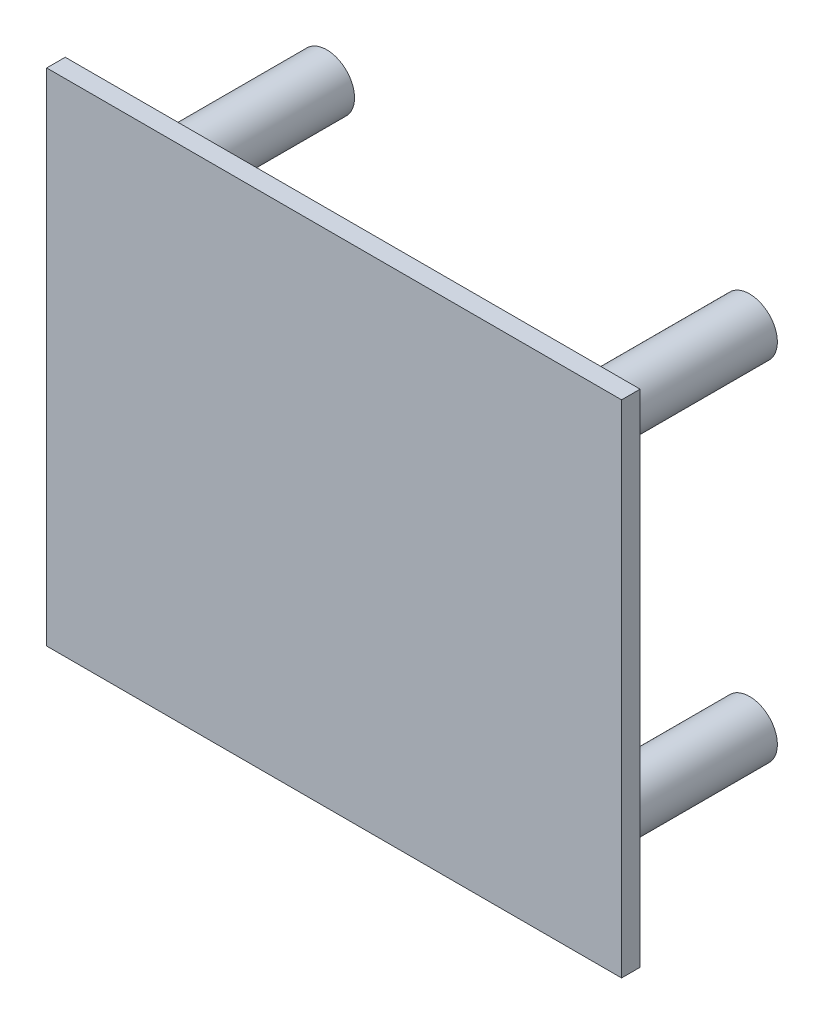
ISO-10303-21;
HEADER;
FILE_DESCRIPTION(('STEP AP214'),'2;1');
FILE_NAME('part.step','',(''),(''),'','','');
FILE_SCHEMA(('AUTOMOTIVE_DESIGN { 1 0 10303 214 1 1 1 1 }'));
ENDSEC;
DATA;
#1=APPLICATION_CONTEXT('core data for automotive mechanical design processes');
#2=APPLICATION_PROTOCOL_DEFINITION('international standard','automotive_design',2000,#1);
#3=PRODUCT_CONTEXT('',#1,'mechanical');
#4=PRODUCT('Part','Part','',(#3));
#5=PRODUCT_RELATED_PRODUCT_CATEGORY('part','',(#4));
#6=PRODUCT_DEFINITION_FORMATION('','',#4);
#7=PRODUCT_DEFINITION_CONTEXT('part definition',#1,'design');
#8=PRODUCT_DEFINITION('design','',#6,#7);
#9=PRODUCT_DEFINITION_SHAPE('','',#8);
#10=(LENGTH_UNIT() NAMED_UNIT(*) SI_UNIT(.MILLI.,.METRE.));
#11=(NAMED_UNIT(*) PLANE_ANGLE_UNIT() SI_UNIT($,.RADIAN.));
#12=(NAMED_UNIT(*) SI_UNIT($,.STERADIAN.) SOLID_ANGLE_UNIT());
#13=UNCERTAINTY_MEASURE_WITH_UNIT(LENGTH_MEASURE(1.E-05),#10,'distance_accuracy_value','');
#14=(GEOMETRIC_REPRESENTATION_CONTEXT(3) GLOBAL_UNCERTAINTY_ASSIGNED_CONTEXT((#13)) GLOBAL_UNIT_ASSIGNED_CONTEXT((#10,
#11,#12)) REPRESENTATION_CONTEXT('',''));
#15=CARTESIAN_POINT('',(0.,0.,0.));
#16=DIRECTION('',(0.,0.,1.));
#17=DIRECTION('',(1.,0.,0.));
#18=AXIS2_PLACEMENT_3D('',#15,#16,#17);
#19=CARTESIAN_POINT('',(15.5,13.5,0.));
#20=DIRECTION('',(0.,0.,-1.));
#21=DIRECTION('',(-1.,0.,0.));
#22=AXIS2_PLACEMENT_3D('',#19,#20,#21);
#23=PLANE('',#22);
#24=CARTESIAN_POINT('',(-11.4,-9.4,0.));
#25=DIRECTION('',(0.,0.,-1.));
#26=DIRECTION('',(-1.,0.,0.));
#27=AXIS2_PLACEMENT_3D('',#24,#25,#26);
#28=CIRCLE('',#27,1.5);
#29=CARTESIAN_POINT('',(-12.9,-9.4,0.));
#30=VERTEX_POINT('',#29);
#31=EDGE_CURVE('E11',#30,#30,#28,.T.);
#32=ORIENTED_EDGE('',*,*,#31,.F.);
#33=EDGE_LOOP('',(#32));
#34=FACE_BOUND('',#33,.T.);
#35=CARTESIAN_POINT('',(11.4,-9.4,0.));
#36=DIRECTION('',(0.,0.,-1.));
#37=DIRECTION('',(-1.,0.,0.));
#38=AXIS2_PLACEMENT_3D('',#35,#36,#37);
#39=CIRCLE('',#38,1.5);
#40=CARTESIAN_POINT('',(9.9,-9.4,0.));
#41=VERTEX_POINT('',#40);
#42=EDGE_CURVE('E134',#41,#41,#39,.T.);
#43=ORIENTED_EDGE('',*,*,#42,.F.);
#44=EDGE_LOOP('',(#43));
#45=FACE_BOUND('',#44,.T.);
#46=DIRECTION('',(0.,1.,0.));
#47=VECTOR('',#46,1.);
#48=CARTESIAN_POINT('',(15.5,-13.5,0.));
#49=LINE('',#48,#47);
#50=CARTESIAN_POINT('',(15.5,-13.5,0.));
#51=VERTEX_POINT('',#50);
#52=CARTESIAN_POINT('',(15.5,13.5,0.));
#53=VERTEX_POINT('',#52);
#54=EDGE_CURVE('E101',#51,#53,#49,.T.);
#55=ORIENTED_EDGE('',*,*,#54,.F.);
#56=DIRECTION('',(1.,0.,0.));
#57=VECTOR('',#56,1.);
#58=CARTESIAN_POINT('',(-15.5,-13.5,0.));
#59=LINE('',#58,#57);
#60=CARTESIAN_POINT('',(-15.5,-13.5,0.));
#61=VERTEX_POINT('',#60);
#62=EDGE_CURVE('E73',#61,#51,#59,.T.);
#63=ORIENTED_EDGE('',*,*,#62,.F.);
#64=DIRECTION('',(0.,-1.,0.));
#65=VECTOR('',#64,1.);
#66=CARTESIAN_POINT('',(-15.5,-13.5,0.));
#67=LINE('',#66,#65);
#68=CARTESIAN_POINT('',(-15.5,13.5,0.));
#69=VERTEX_POINT('',#68);
#70=EDGE_CURVE('E67',#69,#61,#67,.T.);
#71=ORIENTED_EDGE('',*,*,#70,.F.);
#72=DIRECTION('',(-1.,0.,0.));
#73=VECTOR('',#72,1.);
#74=CARTESIAN_POINT('',(-15.5,13.5,0.));
#75=LINE('',#74,#73);
#76=EDGE_CURVE('E91',#53,#69,#75,.T.);
#77=ORIENTED_EDGE('',*,*,#76,.F.);
#78=EDGE_LOOP('',(#55,#63,#71,#77));
#79=FACE_BOUND('',#78,.T.);
#80=CARTESIAN_POINT('',(11.4,9.4,0.));
#81=DIRECTION('',(0.,0.,-1.));
#82=DIRECTION('',(-1.,0.,0.));
#83=AXIS2_PLACEMENT_3D('',#80,#81,#82);
#84=CIRCLE('',#83,1.5);
#85=CARTESIAN_POINT('',(9.9,9.4,0.));
#86=VERTEX_POINT('',#85);
#87=EDGE_CURVE('E42',#86,#86,#84,.T.);
#88=ORIENTED_EDGE('',*,*,#87,.F.);
#89=EDGE_LOOP('',(#88));
#90=FACE_BOUND('',#89,.T.);
#91=CARTESIAN_POINT('',(-11.4,9.4,0.));
#92=DIRECTION('',(0.,0.,-1.));
#93=DIRECTION('',(1.,0.,0.));
#94=AXIS2_PLACEMENT_3D('',#91,#92,#93);
#95=CIRCLE('',#94,1.5);
#96=CARTESIAN_POINT('',(-9.9,9.4,0.));
#97=VERTEX_POINT('',#96);
#98=EDGE_CURVE('E121',#97,#97,#95,.T.);
#99=ORIENTED_EDGE('',*,*,#98,.F.);
#100=EDGE_LOOP('',(#99));
#101=FACE_BOUND('',#100,.T.);
#102=ADVANCED_FACE('F33',(#34,#45,#79,#90,#101),#23,.T.);
#103=CARTESIAN_POINT('',(15.5,-13.5,1.));
#104=DIRECTION('',(-1.,0.,0.));
#105=DIRECTION('',(0.,0.,1.));
#106=AXIS2_PLACEMENT_3D('',#103,#104,#105);
#107=PLANE('',#106);
#108=ORIENTED_EDGE('',*,*,#54,.T.);
#109=DIRECTION('',(0.,0.,-1.));
#110=VECTOR('',#109,1.);
#111=CARTESIAN_POINT('',(15.5,13.5,1.));
#112=LINE('',#111,#110);
#113=CARTESIAN_POINT('',(15.5,13.5,1.));
#114=VERTEX_POINT('',#113);
#115=EDGE_CURVE('E92',#114,#53,#112,.T.);
#116=ORIENTED_EDGE('',*,*,#115,.F.);
#117=DIRECTION('',(0.,1.,0.));
#118=VECTOR('',#117,1.);
#119=CARTESIAN_POINT('',(15.5,-13.5,1.));
#120=LINE('',#119,#118);
#121=CARTESIAN_POINT('',(15.5,-13.5,1.));
#122=VERTEX_POINT('',#121);
#123=EDGE_CURVE('E86',#122,#114,#120,.T.);
#124=ORIENTED_EDGE('',*,*,#123,.F.);
#125=DIRECTION('',(0.,0.,-1.));
#126=VECTOR('',#125,1.);
#127=CARTESIAN_POINT('',(15.5,-13.5,1.));
#128=LINE('',#127,#126);
#129=EDGE_CURVE('E97',#122,#51,#128,.T.);
#130=ORIENTED_EDGE('',*,*,#129,.T.);
#131=EDGE_LOOP('',(#108,#116,#124,#130));
#132=FACE_BOUND('',#131,.T.);
#133=ADVANCED_FACE('F35',(#132),#107,.F.);
#134=CARTESIAN_POINT('',(-15.5,13.5,1.));
#135=DIRECTION('',(0.,-1.,0.));
#136=DIRECTION('',(0.,0.,-1.));
#137=AXIS2_PLACEMENT_3D('',#134,#135,#136);
#138=PLANE('',#137);
#139=ORIENTED_EDGE('',*,*,#76,.T.);
#140=DIRECTION('',(0.,0.,-1.));
#141=VECTOR('',#140,1.);
#142=CARTESIAN_POINT('',(-15.5,13.5,1.));
#143=LINE('',#142,#141);
#144=CARTESIAN_POINT('',(-15.5,13.5,1.));
#145=VERTEX_POINT('',#144);
#146=EDGE_CURVE('E89',#145,#69,#143,.T.);
#147=ORIENTED_EDGE('',*,*,#146,.F.);
#148=DIRECTION('',(-1.,0.,0.));
#149=VECTOR('',#148,1.);
#150=CARTESIAN_POINT('',(-15.5,13.5,1.));
#151=LINE('',#150,#149);
#152=EDGE_CURVE('E81',#114,#145,#151,.T.);
#153=ORIENTED_EDGE('',*,*,#152,.F.);
#154=ORIENTED_EDGE('',*,*,#115,.T.);
#155=EDGE_LOOP('',(#139,#147,#153,#154));
#156=FACE_BOUND('',#155,.T.);
#157=ADVANCED_FACE('F90',(#156),#138,.F.);
#158=CARTESIAN_POINT('',(-15.5,-13.5,1.));
#159=DIRECTION('',(1.,0.,0.));
#160=DIRECTION('',(0.,0.,-1.));
#161=AXIS2_PLACEMENT_3D('',#158,#159,#160);
#162=PLANE('',#161);
#163=ORIENTED_EDGE('',*,*,#70,.T.);
#164=DIRECTION('',(0.,0.,-1.));
#165=VECTOR('',#164,1.);
#166=CARTESIAN_POINT('',(-15.5,-13.5,1.));
#167=LINE('',#166,#165);
#168=CARTESIAN_POINT('',(-15.5,-13.5,1.));
#169=VERTEX_POINT('',#168);
#170=EDGE_CURVE('E93',#169,#61,#167,.T.);
#171=ORIENTED_EDGE('',*,*,#170,.F.);
#172=DIRECTION('',(0.,-1.,0.));
#173=VECTOR('',#172,1.);
#174=CARTESIAN_POINT('',(-15.5,-13.5,1.));
#175=LINE('',#174,#173);
#176=EDGE_CURVE('E84',#145,#169,#175,.T.);
#177=ORIENTED_EDGE('',*,*,#176,.F.);
#178=ORIENTED_EDGE('',*,*,#146,.T.);
#179=EDGE_LOOP('',(#163,#171,#177,#178));
#180=FACE_BOUND('',#179,.T.);
#181=ADVANCED_FACE('F95',(#180),#162,.F.);
#182=CARTESIAN_POINT('',(-15.5,-13.5,1.));
#183=DIRECTION('',(0.,1.,0.));
#184=DIRECTION('',(0.,0.,1.));
#185=AXIS2_PLACEMENT_3D('',#182,#183,#184);
#186=PLANE('',#185);
#187=ORIENTED_EDGE('',*,*,#62,.T.);
#188=ORIENTED_EDGE('',*,*,#129,.F.);
#189=DIRECTION('',(1.,0.,0.));
#190=VECTOR('',#189,1.);
#191=CARTESIAN_POINT('',(-15.5,-13.5,1.));
#192=LINE('',#191,#190);
#193=EDGE_CURVE('E50',#169,#122,#192,.T.);
#194=ORIENTED_EDGE('',*,*,#193,.F.);
#195=ORIENTED_EDGE('',*,*,#170,.T.);
#196=EDGE_LOOP('',(#187,#188,#194,#195));
#197=FACE_BOUND('',#196,.T.);
#198=ADVANCED_FACE('F145',(#197),#186,.F.);
#199=CARTESIAN_POINT('',(15.5,13.5,1.));
#200=DIRECTION('',(0.,0.,-1.));
#201=DIRECTION('',(-1.,0.,0.));
#202=AXIS2_PLACEMENT_3D('',#199,#200,#201);
#203=PLANE('',#202);
#204=ORIENTED_EDGE('',*,*,#123,.T.);
#205=ORIENTED_EDGE('',*,*,#152,.T.);
#206=ORIENTED_EDGE('',*,*,#176,.T.);
#207=ORIENTED_EDGE('',*,*,#193,.T.);
#208=EDGE_LOOP('',(#204,#205,#206,#207));
#209=FACE_BOUND('',#208,.T.);
#210=ADVANCED_FACE('F82',(#209),#203,.F.);
#211=CARTESIAN_POINT('',(11.4,-9.4,-10.));
#212=DIRECTION('',(0.,0.,1.));
#213=DIRECTION('',(1.,0.,0.));
#214=AXIS2_PLACEMENT_3D('',#211,#212,#213);
#215=CYLINDRICAL_SURFACE('',#214,1.5);
#216=CARTESIAN_POINT('',(11.4,-9.4,-10.));
#217=DIRECTION('',(0.,0.,-1.));
#218=DIRECTION('',(-1.,0.,0.));
#219=AXIS2_PLACEMENT_3D('',#216,#217,#218);
#220=CIRCLE('',#219,1.5);
#221=CARTESIAN_POINT('',(9.9,-9.4,-10.));
#222=VERTEX_POINT('',#221);
#223=EDGE_CURVE('E104',#222,#222,#220,.T.);
#224=ORIENTED_EDGE('',*,*,#223,.F.);
#225=EDGE_LOOP('',(#224));
#226=FACE_BOUND('',#225,.T.);
#227=ORIENTED_EDGE('',*,*,#42,.T.);
#228=EDGE_LOOP('',(#227));
#229=FACE_BOUND('',#228,.T.);
#230=ADVANCED_FACE('F140',(#226,#229),#215,.T.);
#231=CARTESIAN_POINT('',(11.4,-9.4,-10.));
#232=DIRECTION('',(0.,0.,-1.));
#233=DIRECTION('',(-1.,0.,0.));
#234=AXIS2_PLACEMENT_3D('',#231,#232,#233);
#235=PLANE('',#234);
#236=ORIENTED_EDGE('',*,*,#223,.T.);
#237=EDGE_LOOP('',(#236));
#238=FACE_BOUND('',#237,.T.);
#239=ADVANCED_FACE('F220',(#238),#235,.T.);
#240=CARTESIAN_POINT('',(11.4,9.4,-10.));
#241=DIRECTION('',(0.,0.,1.));
#242=DIRECTION('',(1.,0.,0.));
#243=AXIS2_PLACEMENT_3D('',#240,#241,#242);
#244=CYLINDRICAL_SURFACE('',#243,1.5);
#245=CARTESIAN_POINT('',(11.4,9.4,-10.));
#246=DIRECTION('',(0.,0.,1.));
#247=DIRECTION('',(-1.,0.,0.));
#248=AXIS2_PLACEMENT_3D('',#245,#246,#247);
#249=CIRCLE('',#248,1.5);
#250=CARTESIAN_POINT('',(9.9,9.4,-10.));
#251=VERTEX_POINT('',#250);
#252=EDGE_CURVE('E127',#251,#251,#249,.T.);
#253=ORIENTED_EDGE('',*,*,#252,.T.);
#254=EDGE_LOOP('',(#253));
#255=FACE_BOUND('',#254,.T.);
#256=ORIENTED_EDGE('',*,*,#87,.T.);
#257=EDGE_LOOP('',(#256));
#258=FACE_BOUND('',#257,.T.);
#259=ADVANCED_FACE('F113',(#255,#258),#244,.T.);
#260=CARTESIAN_POINT('',(11.4,9.4,-10.));
#261=DIRECTION('',(0.,0.,-1.));
#262=DIRECTION('',(-1.,0.,0.));
#263=AXIS2_PLACEMENT_3D('',#260,#261,#262);
#264=PLANE('',#263);
#265=ORIENTED_EDGE('',*,*,#252,.F.);
#266=EDGE_LOOP('',(#265));
#267=FACE_BOUND('',#266,.T.);
#268=ADVANCED_FACE('F172',(#267),#264,.T.);
#269=CARTESIAN_POINT('',(-11.4,9.4,-10.));
#270=DIRECTION('',(0.,0.,1.));
#271=DIRECTION('',(1.,0.,0.));
#272=AXIS2_PLACEMENT_3D('',#269,#270,#271);
#273=CYLINDRICAL_SURFACE('',#272,1.5);
#274=CARTESIAN_POINT('',(-11.4,9.4,-10.));
#275=DIRECTION('',(0.,0.,-1.));
#276=DIRECTION('',(1.,0.,0.));
#277=AXIS2_PLACEMENT_3D('',#274,#275,#276);
#278=CIRCLE('',#277,1.5);
#279=CARTESIAN_POINT('',(-9.9,9.4,-10.));
#280=VERTEX_POINT('',#279);
#281=EDGE_CURVE('E123',#280,#280,#278,.T.);
#282=ORIENTED_EDGE('',*,*,#281,.F.);
#283=EDGE_LOOP('',(#282));
#284=FACE_BOUND('',#283,.T.);
#285=ORIENTED_EDGE('',*,*,#98,.T.);
#286=EDGE_LOOP('',(#285));
#287=FACE_BOUND('',#286,.T.);
#288=ADVANCED_FACE('F176',(#284,#287),#273,.T.);
#289=CARTESIAN_POINT('',(-11.4,9.4,-10.));
#290=DIRECTION('',(0.,0.,-1.));
#291=DIRECTION('',(1.,0.,0.));
#292=AXIS2_PLACEMENT_3D('',#289,#290,#291);
#293=PLANE('',#292);
#294=ORIENTED_EDGE('',*,*,#281,.T.);
#295=EDGE_LOOP('',(#294));
#296=FACE_BOUND('',#295,.T.);
#297=ADVANCED_FACE('F180',(#296),#293,.T.);
#298=CARTESIAN_POINT('',(-11.4,-9.4,-10.));
#299=DIRECTION('',(0.,0.,1.));
#300=DIRECTION('',(1.,0.,0.));
#301=AXIS2_PLACEMENT_3D('',#298,#299,#300);
#302=CYLINDRICAL_SURFACE('',#301,1.5);
#303=CARTESIAN_POINT('',(-11.4,-9.4,-10.));
#304=DIRECTION('',(0.,0.,1.));
#305=DIRECTION('',(1.,0.,0.));
#306=AXIS2_PLACEMENT_3D('',#303,#304,#305);
#307=CIRCLE('',#306,1.5);
#308=CARTESIAN_POINT('',(-9.9,-9.4,-10.));
#309=VERTEX_POINT('',#308);
#310=EDGE_CURVE('E124',#309,#309,#307,.T.);
#311=ORIENTED_EDGE('',*,*,#310,.T.);
#312=EDGE_LOOP('',(#311));
#313=FACE_BOUND('',#312,.T.);
#314=ORIENTED_EDGE('',*,*,#31,.T.);
#315=EDGE_LOOP('',(#314));
#316=FACE_BOUND('',#315,.T.);
#317=ADVANCED_FACE('F190',(#313,#316),#302,.T.);
#318=CARTESIAN_POINT('',(-11.4,-9.4,-10.));
#319=DIRECTION('',(0.,0.,-1.));
#320=DIRECTION('',(1.,0.,0.));
#321=AXIS2_PLACEMENT_3D('',#318,#319,#320);
#322=PLANE('',#321);
#323=ORIENTED_EDGE('',*,*,#310,.F.);
#324=EDGE_LOOP('',(#323));
#325=FACE_BOUND('',#324,.T.);
#326=ADVANCED_FACE('F200',(#325),#322,.T.);
#327=CLOSED_SHELL('',(#102,#133,#157,#181,#198,#210,#230,#239,#259,#268,#288,#297,#317,#326));
#328=MANIFOLD_SOLID_BREP('B2',#327);
#329=ADVANCED_BREP_SHAPE_REPRESENTATION('',(#18,#328),#14);
#330=SHAPE_DEFINITION_REPRESENTATION(#9,#329);
ENDSEC;
END-ISO-10303-21;
